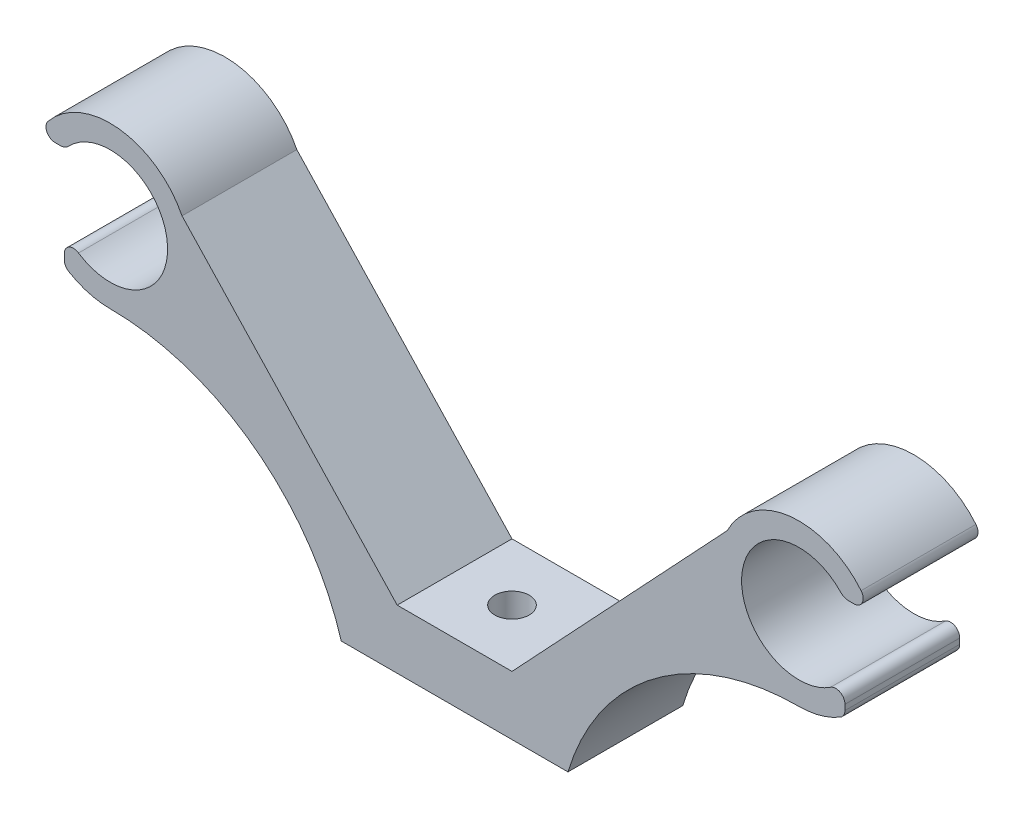
ISO-10303-21;
HEADER;
FILE_DESCRIPTION(('STEP AP214'),'2;1');
FILE_NAME('part.step','',(''),(''),'','','');
FILE_SCHEMA(('AUTOMOTIVE_DESIGN { 1 0 10303 214 1 1 1 1 }'));
ENDSEC;
DATA;
#1=APPLICATION_CONTEXT('core data for automotive mechanical design processes');
#2=APPLICATION_PROTOCOL_DEFINITION('international standard','automotive_design',2000,#1);
#3=PRODUCT_CONTEXT('',#1,'mechanical');
#4=PRODUCT('Part','Part','',(#3));
#5=PRODUCT_RELATED_PRODUCT_CATEGORY('part','',(#4));
#6=PRODUCT_DEFINITION_FORMATION('','',#4);
#7=PRODUCT_DEFINITION_CONTEXT('part definition',#1,'design');
#8=PRODUCT_DEFINITION('design','',#6,#7);
#9=PRODUCT_DEFINITION_SHAPE('','',#8);
#10=(LENGTH_UNIT() NAMED_UNIT(*) SI_UNIT(.MILLI.,.METRE.));
#11=(NAMED_UNIT(*) PLANE_ANGLE_UNIT() SI_UNIT($,.RADIAN.));
#12=(NAMED_UNIT(*) SI_UNIT($,.STERADIAN.) SOLID_ANGLE_UNIT());
#13=UNCERTAINTY_MEASURE_WITH_UNIT(LENGTH_MEASURE(1.E-05),#10,'distance_accuracy_value','');
#14=(GEOMETRIC_REPRESENTATION_CONTEXT(3) GLOBAL_UNCERTAINTY_ASSIGNED_CONTEXT((#13)) GLOBAL_UNIT_ASSIGNED_CONTEXT((#10,
#11,#12)) REPRESENTATION_CONTEXT('',''));
#15=CARTESIAN_POINT('',(0.,0.,0.));
#16=DIRECTION('',(0.,0.,1.));
#17=DIRECTION('',(1.,0.,0.));
#18=AXIS2_PLACEMENT_3D('',#15,#16,#17);
#19=CARTESIAN_POINT('',(-5.,5.14535993764462,10.));
#20=DIRECTION('',(-0.729515847590623,-0.683963908487966,0.));
#21=DIRECTION('',(0.683963908487966,-0.729515847590623,0.));
#22=AXIS2_PLACEMENT_3D('',#19,#20,#21);
#23=PLANE('',#22);
#24=DIRECTION('',(-0.683963908487966,0.729515847590623,0.));
#25=VECTOR('',#24,1.);
#26=CARTESIAN_POINT('',(-5.,5.14535993764462,0.));
#27=LINE('',#26,#25);
#28=CARTESIAN_POINT('',(-5.,5.14535993764462,0.));
#29=VERTEX_POINT('',#28);
#30=CARTESIAN_POINT('',(-23.7410390104122,25.1345505787621,0.));
#31=VERTEX_POINT('',#30);
#32=EDGE_CURVE('E225',#29,#31,#27,.T.);
#33=ORIENTED_EDGE('',*,*,#32,.T.);
#34=DIRECTION('',(0.,0.,-1.));
#35=VECTOR('',#34,1.);
#36=CARTESIAN_POINT('',(-23.7410390104122,25.1345505787621,10.));
#37=LINE('',#36,#35);
#38=CARTESIAN_POINT('',(-23.7410390104122,25.1345505787621,10.));
#39=VERTEX_POINT('',#38);
#40=EDGE_CURVE('E11',#39,#31,#37,.T.);
#41=ORIENTED_EDGE('',*,*,#40,.F.);
#42=DIRECTION('',(-0.683963908487966,0.729515847590623,0.));
#43=VECTOR('',#42,1.);
#44=CARTESIAN_POINT('',(-5.,5.14535993764462,10.));
#45=LINE('',#44,#43);
#46=CARTESIAN_POINT('',(-5.,5.14535993764462,10.));
#47=VERTEX_POINT('',#46);
#48=EDGE_CURVE('E272',#47,#39,#45,.T.);
#49=ORIENTED_EDGE('',*,*,#48,.F.);
#50=DIRECTION('',(0.,0.,-1.));
#51=VECTOR('',#50,1.);
#52=CARTESIAN_POINT('',(-5.,5.14535993764462,10.));
#53=LINE('',#52,#51);
#54=EDGE_CURVE('E221',#47,#29,#53,.T.);
#55=ORIENTED_EDGE('',*,*,#54,.T.);
#56=EDGE_LOOP('',(#33,#41,#49,#55));
#57=FACE_BOUND('',#56,.T.);
#58=ADVANCED_FACE('F33',(#57),#23,.F.);
#59=CARTESIAN_POINT('',(-30.,22.,10.));
#60=DIRECTION('',(0.,0.,-1.));
#61=DIRECTION('',(-1.,0.,0.));
#62=AXIS2_PLACEMENT_3D('',#59,#60,#61);
#63=CYLINDRICAL_SURFACE('',#62,7.);
#64=CARTESIAN_POINT('',(-30.,22.,0.));
#65=DIRECTION('',(0.,0.,1.));
#66=DIRECTION('',(1.,0.,0.));
#67=AXIS2_PLACEMENT_3D('',#64,#65,#66);
#68=CIRCLE('',#67,7.);
#69=CARTESIAN_POINT('',(-35.4098569694725,26.4422345244088,0.));
#70=VERTEX_POINT('',#69);
#71=EDGE_CURVE('E228',#31,#70,#68,.T.);
#72=ORIENTED_EDGE('',*,*,#71,.T.);
#73=DIRECTION('',(0.,0.,-1.));
#74=VECTOR('',#73,1.);
#75=CARTESIAN_POINT('',(-35.4098569694725,26.4422345244088,10.));
#76=LINE('',#75,#74);
#77=CARTESIAN_POINT('',(-35.4098569694725,26.4422345244088,10.));
#78=VERTEX_POINT('',#77);
#79=EDGE_CURVE('E41',#78,#70,#76,.T.);
#80=ORIENTED_EDGE('',*,*,#79,.F.);
#81=CARTESIAN_POINT('',(-30.,22.,10.));
#82=DIRECTION('',(0.,0.,1.));
#83=DIRECTION('',(1.,0.,0.));
#84=AXIS2_PLACEMENT_3D('',#81,#82,#83);
#85=CIRCLE('',#84,7.);
#86=EDGE_CURVE('E140',#39,#78,#85,.T.);
#87=ORIENTED_EDGE('',*,*,#86,.F.);
#88=ORIENTED_EDGE('',*,*,#40,.T.);
#89=EDGE_LOOP('',(#72,#80,#87,#88));
#90=FACE_BOUND('',#89,.T.);
#91=ADVANCED_FACE('F414',(#90),#63,.T.);
#92=CARTESIAN_POINT('',(-34.7915876015328,25.9345505787621,10.));
#93=DIRECTION('',(0.,0.,-1.));
#94=DIRECTION('',(-1.,0.,0.));
#95=AXIS2_PLACEMENT_3D('',#92,#93,#94);
#96=CYLINDRICAL_SURFACE('',#95,0.800000000000001);
#97=CARTESIAN_POINT('',(-34.7915876015328,25.9345505787621,0.));
#98=DIRECTION('',(0.,0.,1.));
#99=DIRECTION('',(-1.,0.,0.));
#100=AXIS2_PLACEMENT_3D('',#97,#98,#99);
#101=CIRCLE('',#100,0.800000000000001);
#102=CARTESIAN_POINT('',(-34.7915876015328,25.1345505787621,0.));
#103=VERTEX_POINT('',#102);
#104=EDGE_CURVE('E231',#70,#103,#101,.T.);
#105=ORIENTED_EDGE('',*,*,#104,.T.);
#106=DIRECTION('',(0.,0.,-1.));
#107=VECTOR('',#106,1.);
#108=CARTESIAN_POINT('',(-34.7915876015328,25.1345505787621,10.));
#109=LINE('',#108,#107);
#110=CARTESIAN_POINT('',(-34.7915876015328,25.1345505787621,10.));
#111=VERTEX_POINT('',#110);
#112=EDGE_CURVE('E327',#111,#103,#109,.T.);
#113=ORIENTED_EDGE('',*,*,#112,.F.);
#114=CARTESIAN_POINT('',(-34.7915876015328,25.9345505787621,10.));
#115=DIRECTION('',(0.,0.,1.));
#116=DIRECTION('',(-1.,0.,0.));
#117=AXIS2_PLACEMENT_3D('',#114,#115,#116);
#118=CIRCLE('',#117,0.800000000000001);
#119=EDGE_CURVE('E335',#78,#111,#118,.T.);
#120=ORIENTED_EDGE('',*,*,#119,.F.);
#121=ORIENTED_EDGE('',*,*,#79,.T.);
#122=EDGE_LOOP('',(#105,#113,#120,#121));
#123=FACE_BOUND('',#122,.T.);
#124=ADVANCED_FACE('F333',(#123),#96,.T.);
#125=CARTESIAN_POINT('',(-34.3480445618298,25.1345505787621,10.));
#126=DIRECTION('',(0.,1.,0.));
#127=DIRECTION('',(-1.,0.,0.));
#128=AXIS2_PLACEMENT_3D('',#125,#126,#127);
#129=PLANE('',#128);
#130=DIRECTION('',(1.,0.,0.));
#131=VECTOR('',#130,1.);
#132=CARTESIAN_POINT('',(-34.3480445618298,25.1345505787621,0.));
#133=LINE('',#132,#131);
#134=CARTESIAN_POINT('',(-34.3480445618298,25.1345505787621,0.));
#135=VERTEX_POINT('',#134);
#136=EDGE_CURVE('E233',#103,#135,#133,.T.);
#137=ORIENTED_EDGE('',*,*,#136,.T.);
#138=DIRECTION('',(0.,0.,-1.));
#139=VECTOR('',#138,1.);
#140=CARTESIAN_POINT('',(-34.3480445618298,25.1345505787621,10.));
#141=LINE('',#140,#139);
#142=CARTESIAN_POINT('',(-34.3480445618298,25.1345505787621,10.));
#143=VERTEX_POINT('',#142);
#144=EDGE_CURVE('E324',#143,#135,#141,.T.);
#145=ORIENTED_EDGE('',*,*,#144,.F.);
#146=DIRECTION('',(1.,0.,0.));
#147=VECTOR('',#146,1.);
#148=CARTESIAN_POINT('',(-34.3480445618298,25.1345505787621,10.));
#149=LINE('',#148,#147);
#150=EDGE_CURVE('E353',#111,#143,#149,.T.);
#151=ORIENTED_EDGE('',*,*,#150,.F.);
#152=ORIENTED_EDGE('',*,*,#112,.T.);
#153=EDGE_LOOP('',(#137,#145,#151,#152));
#154=FACE_BOUND('',#153,.T.);
#155=ADVANCED_FACE('F344',(#154),#129,.F.);
#156=CARTESIAN_POINT('',(-34.3480445618298,26.1345505787621,10.));
#157=DIRECTION('',(0.,0.,-1.));
#158=DIRECTION('',(-1.,0.,0.));
#159=AXIS2_PLACEMENT_3D('',#156,#157,#158);
#160=CYLINDRICAL_SURFACE('',#159,1.);
#161=CARTESIAN_POINT('',(-34.3480445618298,26.1345505787621,0.));
#162=DIRECTION('',(0.,0.,1.));
#163=DIRECTION('',(1.,0.,0.));
#164=AXIS2_PLACEMENT_3D('',#161,#162,#163);
#165=CIRCLE('',#164,1.);
#166=CARTESIAN_POINT('',(-33.6233704681915,25.4454588156351,0.));
#167=VERTEX_POINT('',#166);
#168=EDGE_CURVE('E235',#135,#167,#165,.T.);
#169=ORIENTED_EDGE('',*,*,#168,.T.);
#170=DIRECTION('',(0.,0.,-1.));
#171=VECTOR('',#170,1.);
#172=CARTESIAN_POINT('',(-33.6233704681915,25.4454588156351,10.));
#173=LINE('',#172,#171);
#174=CARTESIAN_POINT('',(-33.6233704681915,25.4454588156351,10.));
#175=VERTEX_POINT('',#174);
#176=EDGE_CURVE('E321',#175,#167,#173,.T.);
#177=ORIENTED_EDGE('',*,*,#176,.F.);
#178=CARTESIAN_POINT('',(-34.3480445618298,26.1345505787621,10.));
#179=DIRECTION('',(0.,0.,1.));
#180=DIRECTION('',(1.,0.,0.));
#181=AXIS2_PLACEMENT_3D('',#178,#179,#180);
#182=CIRCLE('',#181,1.);
#183=EDGE_CURVE('E350',#143,#175,#182,.T.);
#184=ORIENTED_EDGE('',*,*,#183,.F.);
#185=ORIENTED_EDGE('',*,*,#144,.T.);
#186=EDGE_LOOP('',(#169,#177,#184,#185));
#187=FACE_BOUND('',#186,.T.);
#188=ADVANCED_FACE('F348',(#187),#160,.T.);
#189=CARTESIAN_POINT('',(-30.,22.,10.));
#190=DIRECTION('',(0.,0.,-1.));
#191=DIRECTION('',(-1.,0.,0.));
#192=AXIS2_PLACEMENT_3D('',#189,#190,#191);
#193=CYLINDRICAL_SURFACE('',#192,5.);
#194=CARTESIAN_POINT('',(-30.,22.,0.));
#195=DIRECTION('',(0.,0.,-1.));
#196=DIRECTION('',(1.,0.,0.));
#197=AXIS2_PLACEMENT_3D('',#194,#195,#196);
#198=CIRCLE('',#197,5.);
#199=CARTESIAN_POINT('',(-32.7586206896552,17.8298666819145,0.));
#200=VERTEX_POINT('',#199);
#201=EDGE_CURVE('E237',#167,#200,#198,.T.);
#202=ORIENTED_EDGE('',*,*,#201,.T.);
#203=DIRECTION('',(0.,0.,-1.));
#204=VECTOR('',#203,1.);
#205=CARTESIAN_POINT('',(-32.7586206896552,17.8298666819145,10.));
#206=LINE('',#205,#204);
#207=CARTESIAN_POINT('',(-32.7586206896552,17.8298666819145,10.));
#208=VERTEX_POINT('',#207);
#209=EDGE_CURVE('E318',#208,#200,#206,.T.);
#210=ORIENTED_EDGE('',*,*,#209,.F.);
#211=CARTESIAN_POINT('',(-30.,22.,10.));
#212=DIRECTION('',(0.,0.,-1.));
#213=DIRECTION('',(1.,0.,0.));
#214=AXIS2_PLACEMENT_3D('',#211,#212,#213);
#215=CIRCLE('',#214,5.);
#216=EDGE_CURVE('E352',#175,#208,#215,.T.);
#217=ORIENTED_EDGE('',*,*,#216,.F.);
#218=ORIENTED_EDGE('',*,*,#176,.T.);
#219=EDGE_LOOP('',(#202,#210,#217,#218));
#220=FACE_BOUND('',#219,.T.);
#221=ADVANCED_FACE('F427',(#220),#193,.F.);
#222=CARTESIAN_POINT('',(-33.2,17.1626453510209,10.));
#223=DIRECTION('',(0.,0.,-1.));
#224=DIRECTION('',(-1.,0.,0.));
#225=AXIS2_PLACEMENT_3D('',#222,#223,#224);
#226=CYLINDRICAL_SURFACE('',#225,0.8);
#227=CARTESIAN_POINT('',(-33.2,17.1626453510209,0.));
#228=DIRECTION('',(0.,0.,1.));
#229=DIRECTION('',(-1.,0.,0.));
#230=AXIS2_PLACEMENT_3D('',#227,#228,#229);
#231=CIRCLE('',#230,0.8);
#232=CARTESIAN_POINT('',(-34.,17.1626453510209,0.));
#233=VERTEX_POINT('',#232);
#234=EDGE_CURVE('E239',#200,#233,#231,.T.);
#235=ORIENTED_EDGE('',*,*,#234,.T.);
#236=DIRECTION('',(0.,0.,-1.));
#237=VECTOR('',#236,1.);
#238=CARTESIAN_POINT('',(-34.,17.1626453510209,10.));
#239=LINE('',#238,#237);
#240=CARTESIAN_POINT('',(-34.,17.1626453510209,10.));
#241=VERTEX_POINT('',#240);
#242=EDGE_CURVE('E315',#241,#233,#239,.T.);
#243=ORIENTED_EDGE('',*,*,#242,.F.);
#244=CARTESIAN_POINT('',(-33.2,17.1626453510209,10.));
#245=DIRECTION('',(0.,0.,1.));
#246=DIRECTION('',(-1.,0.,0.));
#247=AXIS2_PLACEMENT_3D('',#244,#245,#246);
#248=CIRCLE('',#247,0.8);
#249=EDGE_CURVE('E355',#208,#241,#248,.T.);
#250=ORIENTED_EDGE('',*,*,#249,.F.);
#251=ORIENTED_EDGE('',*,*,#209,.T.);
#252=EDGE_LOOP('',(#235,#243,#250,#251));
#253=FACE_BOUND('',#252,.T.);
#254=ADVANCED_FACE('F430',(#253),#226,.T.);
#255=CARTESIAN_POINT('',(-34.,16.6896327810593,10.));
#256=DIRECTION('',(1.,0.,0.));
#257=DIRECTION('',(0.,0.,-1.));
#258=AXIS2_PLACEMENT_3D('',#255,#256,#257);
#259=PLANE('',#258);
#260=DIRECTION('',(0.,-1.,0.));
#261=VECTOR('',#260,1.);
#262=CARTESIAN_POINT('',(-34.,16.6896327810593,0.));
#263=LINE('',#262,#261);
#264=CARTESIAN_POINT('',(-34.,16.6896327810593,0.));
#265=VERTEX_POINT('',#264);
#266=EDGE_CURVE('E241',#233,#265,#263,.T.);
#267=ORIENTED_EDGE('',*,*,#266,.T.);
#268=DIRECTION('',(0.,0.,-1.));
#269=VECTOR('',#268,1.);
#270=CARTESIAN_POINT('',(-34.,16.6896327810593,10.));
#271=LINE('',#270,#269);
#272=CARTESIAN_POINT('',(-34.,16.6896327810593,10.));
#273=VERTEX_POINT('',#272);
#274=EDGE_CURVE('E312',#273,#265,#271,.T.);
#275=ORIENTED_EDGE('',*,*,#274,.F.);
#276=DIRECTION('',(0.,-1.,0.));
#277=VECTOR('',#276,1.);
#278=CARTESIAN_POINT('',(-34.,16.6896327810593,10.));
#279=LINE('',#278,#277);
#280=EDGE_CURVE('E361',#241,#273,#279,.T.);
#281=ORIENTED_EDGE('',*,*,#280,.F.);
#282=ORIENTED_EDGE('',*,*,#242,.T.);
#283=EDGE_LOOP('',(#267,#275,#281,#282));
#284=FACE_BOUND('',#283,.T.);
#285=ADVANCED_FACE('F434',(#284),#259,.F.);
#286=CARTESIAN_POINT('',(-33.2,16.6896327810593,10.));
#287=DIRECTION('',(0.,0.,-1.));
#288=DIRECTION('',(-1.,0.,0.));
#289=AXIS2_PLACEMENT_3D('',#286,#287,#288);
#290=CYLINDRICAL_SURFACE('',#289,0.800000000000003);
#291=CARTESIAN_POINT('',(-33.2,16.6896327810593,0.));
#292=DIRECTION('',(0.,0.,1.));
#293=DIRECTION('',(1.,0.,0.));
#294=AXIS2_PLACEMENT_3D('',#291,#292,#293);
#295=CIRCLE('',#294,0.800000000000003);
#296=CARTESIAN_POINT('',(-33.6129032258065,16.0044241076476,0.));
#297=VERTEX_POINT('',#296);
#298=EDGE_CURVE('E243',#265,#297,#295,.T.);
#299=ORIENTED_EDGE('',*,*,#298,.T.);
#300=DIRECTION('',(0.,0.,-1.));
#301=VECTOR('',#300,1.);
#302=CARTESIAN_POINT('',(-33.6129032258065,16.0044241076476,10.));
#303=LINE('',#302,#301);
#304=CARTESIAN_POINT('',(-33.6129032258065,16.0044241076476,10.));
#305=VERTEX_POINT('',#304);
#306=EDGE_CURVE('E309',#305,#297,#303,.T.);
#307=ORIENTED_EDGE('',*,*,#306,.F.);
#308=CARTESIAN_POINT('',(-33.2,16.6896327810593,10.));
#309=DIRECTION('',(0.,0.,1.));
#310=DIRECTION('',(1.,0.,0.));
#311=AXIS2_PLACEMENT_3D('',#308,#309,#310);
#312=CIRCLE('',#311,0.800000000000003);
#313=EDGE_CURVE('E363',#273,#305,#312,.T.);
#314=ORIENTED_EDGE('',*,*,#313,.F.);
#315=ORIENTED_EDGE('',*,*,#274,.T.);
#316=EDGE_LOOP('',(#299,#307,#314,#315));
#317=FACE_BOUND('',#316,.T.);
#318=ADVANCED_FACE('F438',(#317),#290,.T.);
#319=CARTESIAN_POINT('',(-30.,22.,10.));
#320=DIRECTION('',(0.,0.,-1.));
#321=DIRECTION('',(-1.,0.,0.));
#322=AXIS2_PLACEMENT_3D('',#319,#320,#321);
#323=CYLINDRICAL_SURFACE('',#322,7.);
#324=CARTESIAN_POINT('',(-30.,22.,0.));
#325=DIRECTION('',(0.,0.,1.));
#326=DIRECTION('',(1.,0.,0.));
#327=AXIS2_PLACEMENT_3D('',#324,#325,#326);
#328=CIRCLE('',#327,7.);
#329=CARTESIAN_POINT('',(-30.,15.,0.));
#330=VERTEX_POINT('',#329);
#331=EDGE_CURVE('E245',#297,#330,#328,.T.);
#332=ORIENTED_EDGE('',*,*,#331,.T.);
#333=DIRECTION('',(0.,0.,-1.));
#334=VECTOR('',#333,1.);
#335=CARTESIAN_POINT('',(-30.,15.,10.));
#336=LINE('',#335,#334);
#337=CARTESIAN_POINT('',(-30.,15.,10.));
#338=VERTEX_POINT('',#337);
#339=EDGE_CURVE('E306',#338,#330,#336,.T.);
#340=ORIENTED_EDGE('',*,*,#339,.F.);
#341=CARTESIAN_POINT('',(-30.,22.,10.));
#342=DIRECTION('',(0.,0.,1.));
#343=DIRECTION('',(1.,0.,0.));
#344=AXIS2_PLACEMENT_3D('',#341,#342,#343);
#345=CIRCLE('',#344,7.);
#346=EDGE_CURVE('E365',#305,#338,#345,.T.);
#347=ORIENTED_EDGE('',*,*,#346,.F.);
#348=ORIENTED_EDGE('',*,*,#306,.T.);
#349=EDGE_LOOP('',(#332,#340,#347,#348));
#350=FACE_BOUND('',#349,.T.);
#351=ADVANCED_FACE('F442',(#350),#323,.T.);
#352=CARTESIAN_POINT('',(-30.,-6.,10.));
#353=DIRECTION('',(0.,0.,-1.));
#354=DIRECTION('',(-1.,0.,0.));
#355=AXIS2_PLACEMENT_3D('',#352,#353,#354);
#356=CYLINDRICAL_SURFACE('',#355,21.);
#357=CARTESIAN_POINT('',(-30.,-6.,0.));
#358=DIRECTION('',(0.,0.,-1.));
#359=DIRECTION('',(1.,0.,0.));
#360=AXIS2_PLACEMENT_3D('',#357,#358,#359);
#361=CIRCLE('',#360,21.);
#362=CARTESIAN_POINT('',(-9.87538820250189,0.,0.));
#363=VERTEX_POINT('',#362);
#364=EDGE_CURVE('E247',#330,#363,#361,.T.);
#365=ORIENTED_EDGE('',*,*,#364,.T.);
#366=DIRECTION('',(0.,0.,-1.));
#367=VECTOR('',#366,1.);
#368=CARTESIAN_POINT('',(-9.87538820250189,0.,10.));
#369=LINE('',#368,#367);
#370=CARTESIAN_POINT('',(-9.87538820250189,0.,10.));
#371=VERTEX_POINT('',#370);
#372=EDGE_CURVE('E303',#371,#363,#369,.T.);
#373=ORIENTED_EDGE('',*,*,#372,.F.);
#374=CARTESIAN_POINT('',(-30.,-6.,10.));
#375=DIRECTION('',(0.,0.,-1.));
#376=DIRECTION('',(1.,0.,0.));
#377=AXIS2_PLACEMENT_3D('',#374,#375,#376);
#378=CIRCLE('',#377,21.);
#379=EDGE_CURVE('E367',#338,#371,#378,.T.);
#380=ORIENTED_EDGE('',*,*,#379,.F.);
#381=ORIENTED_EDGE('',*,*,#339,.T.);
#382=EDGE_LOOP('',(#365,#373,#380,#381));
#383=FACE_BOUND('',#382,.T.);
#384=ADVANCED_FACE('F446',(#383),#356,.F.);
#385=CARTESIAN_POINT('',(9.87538820250189,0.,10.));
#386=DIRECTION('',(0.,1.,0.));
#387=DIRECTION('',(0.,0.,1.));
#388=AXIS2_PLACEMENT_3D('',#385,#386,#387);
#389=PLANE('',#388);
#390=CARTESIAN_POINT('',(0.,0.,5.));
#391=DIRECTION('',(0.,1.,0.));
#392=DIRECTION('',(0.,0.,1.));
#393=AXIS2_PLACEMENT_3D('',#390,#391,#392);
#394=CIRCLE('',#393,1.5);
#395=CARTESIAN_POINT('',(0.,0.,6.5));
#396=VERTEX_POINT('',#395);
#397=EDGE_CURVE('E229',#396,#396,#394,.T.);
#398=ORIENTED_EDGE('',*,*,#397,.T.);
#399=EDGE_LOOP('',(#398));
#400=FACE_BOUND('',#399,.T.);
#401=DIRECTION('',(1.,0.,0.));
#402=VECTOR('',#401,1.);
#403=CARTESIAN_POINT('',(9.87538820250189,0.,0.));
#404=LINE('',#403,#402);
#405=CARTESIAN_POINT('',(9.87538820250189,0.,0.));
#406=VERTEX_POINT('',#405);
#407=EDGE_CURVE('E249',#363,#406,#404,.T.);
#408=ORIENTED_EDGE('',*,*,#407,.T.);
#409=DIRECTION('',(0.,0.,-1.));
#410=VECTOR('',#409,1.);
#411=CARTESIAN_POINT('',(9.87538820250189,0.,10.));
#412=LINE('',#411,#410);
#413=CARTESIAN_POINT('',(9.87538820250189,0.,10.));
#414=VERTEX_POINT('',#413);
#415=EDGE_CURVE('E300',#414,#406,#412,.T.);
#416=ORIENTED_EDGE('',*,*,#415,.F.);
#417=DIRECTION('',(1.,0.,0.));
#418=VECTOR('',#417,1.);
#419=CARTESIAN_POINT('',(9.87538820250189,0.,10.));
#420=LINE('',#419,#418);
#421=EDGE_CURVE('E369',#371,#414,#420,.T.);
#422=ORIENTED_EDGE('',*,*,#421,.F.);
#423=ORIENTED_EDGE('',*,*,#372,.T.);
#424=EDGE_LOOP('',(#408,#416,#422,#423));
#425=FACE_BOUND('',#424,.T.);
#426=ADVANCED_FACE('F450',(#400,#425),#389,.F.);
#427=CARTESIAN_POINT('',(30.,-6.,10.));
#428=DIRECTION('',(0.,0.,-1.));
#429=DIRECTION('',(-1.,0.,0.));
#430=AXIS2_PLACEMENT_3D('',#427,#428,#429);
#431=CYLINDRICAL_SURFACE('',#430,21.);
#432=CARTESIAN_POINT('',(30.,-6.,0.));
#433=DIRECTION('',(0.,0.,-1.));
#434=DIRECTION('',(-1.,0.,0.));
#435=AXIS2_PLACEMENT_3D('',#432,#433,#434);
#436=CIRCLE('',#435,21.);
#437=CARTESIAN_POINT('',(30.,15.,0.));
#438=VERTEX_POINT('',#437);
#439=EDGE_CURVE('E251',#406,#438,#436,.T.);
#440=ORIENTED_EDGE('',*,*,#439,.T.);
#441=DIRECTION('',(0.,0.,-1.));
#442=VECTOR('',#441,1.);
#443=CARTESIAN_POINT('',(30.,15.,10.));
#444=LINE('',#443,#442);
#445=CARTESIAN_POINT('',(30.,15.,10.));
#446=VERTEX_POINT('',#445);
#447=EDGE_CURVE('E297',#446,#438,#444,.T.);
#448=ORIENTED_EDGE('',*,*,#447,.F.);
#449=CARTESIAN_POINT('',(30.,-6.,10.));
#450=DIRECTION('',(0.,0.,-1.));
#451=DIRECTION('',(-1.,0.,0.));
#452=AXIS2_PLACEMENT_3D('',#449,#450,#451);
#453=CIRCLE('',#452,21.);
#454=EDGE_CURVE('E371',#414,#446,#453,.T.);
#455=ORIENTED_EDGE('',*,*,#454,.F.);
#456=ORIENTED_EDGE('',*,*,#415,.T.);
#457=EDGE_LOOP('',(#440,#448,#455,#456));
#458=FACE_BOUND('',#457,.T.);
#459=ADVANCED_FACE('F453',(#458),#431,.F.);
#460=CARTESIAN_POINT('',(30.,22.,10.));
#461=DIRECTION('',(0.,0.,-1.));
#462=DIRECTION('',(-1.,0.,0.));
#463=AXIS2_PLACEMENT_3D('',#460,#461,#462);
#464=CYLINDRICAL_SURFACE('',#463,7.);
#465=CARTESIAN_POINT('',(30.,22.,0.));
#466=DIRECTION('',(0.,0.,1.));
#467=DIRECTION('',(-1.,0.,0.));
#468=AXIS2_PLACEMENT_3D('',#465,#466,#467);
#469=CIRCLE('',#468,7.);
#470=CARTESIAN_POINT('',(33.6129032258065,16.0044241076476,0.));
#471=VERTEX_POINT('',#470);
#472=EDGE_CURVE('E253',#438,#471,#469,.T.);
#473=ORIENTED_EDGE('',*,*,#472,.T.);
#474=DIRECTION('',(0.,0.,-1.));
#475=VECTOR('',#474,1.);
#476=CARTESIAN_POINT('',(33.6129032258065,16.0044241076476,10.));
#477=LINE('',#476,#475);
#478=CARTESIAN_POINT('',(33.6129032258065,16.0044241076476,10.));
#479=VERTEX_POINT('',#478);
#480=EDGE_CURVE('E294',#479,#471,#477,.T.);
#481=ORIENTED_EDGE('',*,*,#480,.F.);
#482=CARTESIAN_POINT('',(30.,22.,10.));
#483=DIRECTION('',(0.,0.,1.));
#484=DIRECTION('',(-1.,0.,0.));
#485=AXIS2_PLACEMENT_3D('',#482,#483,#484);
#486=CIRCLE('',#485,7.);
#487=EDGE_CURVE('E373',#446,#479,#486,.T.);
#488=ORIENTED_EDGE('',*,*,#487,.F.);
#489=ORIENTED_EDGE('',*,*,#447,.T.);
#490=EDGE_LOOP('',(#473,#481,#488,#489));
#491=FACE_BOUND('',#490,.T.);
#492=ADVANCED_FACE('F457',(#491),#464,.T.);
#493=CARTESIAN_POINT('',(33.2,16.6896327810593,10.));
#494=DIRECTION('',(0.,0.,-1.));
#495=DIRECTION('',(-1.,0.,0.));
#496=AXIS2_PLACEMENT_3D('',#493,#494,#495);
#497=CYLINDRICAL_SURFACE('',#496,0.800000000000003);
#498=CARTESIAN_POINT('',(33.2,16.6896327810593,0.));
#499=DIRECTION('',(0.,0.,1.));
#500=DIRECTION('',(-1.,0.,0.));
#501=AXIS2_PLACEMENT_3D('',#498,#499,#500);
#502=CIRCLE('',#501,0.800000000000003);
#503=CARTESIAN_POINT('',(34.,16.6896327810593,0.));
#504=VERTEX_POINT('',#503);
#505=EDGE_CURVE('E255',#471,#504,#502,.T.);
#506=ORIENTED_EDGE('',*,*,#505,.T.);
#507=DIRECTION('',(0.,0.,-1.));
#508=VECTOR('',#507,1.);
#509=CARTESIAN_POINT('',(34.,16.6896327810593,10.));
#510=LINE('',#509,#508);
#511=CARTESIAN_POINT('',(34.,16.6896327810593,10.));
#512=VERTEX_POINT('',#511);
#513=EDGE_CURVE('E291',#512,#504,#510,.T.);
#514=ORIENTED_EDGE('',*,*,#513,.F.);
#515=CARTESIAN_POINT('',(33.2,16.6896327810593,10.));
#516=DIRECTION('',(0.,0.,1.));
#517=DIRECTION('',(-1.,0.,0.));
#518=AXIS2_PLACEMENT_3D('',#515,#516,#517);
#519=CIRCLE('',#518,0.800000000000003);
#520=EDGE_CURVE('E375',#479,#512,#519,.T.);
#521=ORIENTED_EDGE('',*,*,#520,.F.);
#522=ORIENTED_EDGE('',*,*,#480,.T.);
#523=EDGE_LOOP('',(#506,#514,#521,#522));
#524=FACE_BOUND('',#523,.T.);
#525=ADVANCED_FACE('F461',(#524),#497,.T.);
#526=CARTESIAN_POINT('',(34.,16.6896327810593,10.));
#527=DIRECTION('',(-1.,0.,0.));
#528=DIRECTION('',(0.,0.,1.));
#529=AXIS2_PLACEMENT_3D('',#526,#527,#528);
#530=PLANE('',#529);
#531=DIRECTION('',(0.,1.,0.));
#532=VECTOR('',#531,1.);
#533=CARTESIAN_POINT('',(34.,16.6896327810593,0.));
#534=LINE('',#533,#532);
#535=CARTESIAN_POINT('',(34.,17.1626453510209,0.));
#536=VERTEX_POINT('',#535);
#537=EDGE_CURVE('E257',#504,#536,#534,.T.);
#538=ORIENTED_EDGE('',*,*,#537,.T.);
#539=DIRECTION('',(0.,0.,-1.));
#540=VECTOR('',#539,1.);
#541=CARTESIAN_POINT('',(34.,17.1626453510209,10.));
#542=LINE('',#541,#540);
#543=CARTESIAN_POINT('',(34.,17.1626453510209,10.));
#544=VERTEX_POINT('',#543);
#545=EDGE_CURVE('E288',#544,#536,#542,.T.);
#546=ORIENTED_EDGE('',*,*,#545,.F.);
#547=DIRECTION('',(0.,1.,0.));
#548=VECTOR('',#547,1.);
#549=CARTESIAN_POINT('',(34.,16.6896327810593,10.));
#550=LINE('',#549,#548);
#551=EDGE_CURVE('E377',#512,#544,#550,.T.);
#552=ORIENTED_EDGE('',*,*,#551,.F.);
#553=ORIENTED_EDGE('',*,*,#513,.T.);
#554=EDGE_LOOP('',(#538,#546,#552,#553));
#555=FACE_BOUND('',#554,.T.);
#556=ADVANCED_FACE('F465',(#555),#530,.F.);
#557=CARTESIAN_POINT('',(33.2,17.1626453510209,10.));
#558=DIRECTION('',(0.,0.,-1.));
#559=DIRECTION('',(-1.,0.,0.));
#560=AXIS2_PLACEMENT_3D('',#557,#558,#559);
#561=CYLINDRICAL_SURFACE('',#560,0.8);
#562=CARTESIAN_POINT('',(33.2,17.1626453510209,0.));
#563=DIRECTION('',(0.,0.,1.));
#564=DIRECTION('',(1.,0.,0.));
#565=AXIS2_PLACEMENT_3D('',#562,#563,#564);
#566=CIRCLE('',#565,0.8);
#567=CARTESIAN_POINT('',(32.7586206896552,17.8298666819145,0.));
#568=VERTEX_POINT('',#567);
#569=EDGE_CURVE('E259',#536,#568,#566,.T.);
#570=ORIENTED_EDGE('',*,*,#569,.T.);
#571=DIRECTION('',(0.,0.,-1.));
#572=VECTOR('',#571,1.);
#573=CARTESIAN_POINT('',(32.7586206896552,17.8298666819145,10.));
#574=LINE('',#573,#572);
#575=CARTESIAN_POINT('',(32.7586206896552,17.8298666819145,10.));
#576=VERTEX_POINT('',#575);
#577=EDGE_CURVE('E285',#576,#568,#574,.T.);
#578=ORIENTED_EDGE('',*,*,#577,.F.);
#579=CARTESIAN_POINT('',(33.2,17.1626453510209,10.));
#580=DIRECTION('',(0.,0.,1.));
#581=DIRECTION('',(1.,0.,0.));
#582=AXIS2_PLACEMENT_3D('',#579,#580,#581);
#583=CIRCLE('',#582,0.8);
#584=EDGE_CURVE('E379',#544,#576,#583,.T.);
#585=ORIENTED_EDGE('',*,*,#584,.F.);
#586=ORIENTED_EDGE('',*,*,#545,.T.);
#587=EDGE_LOOP('',(#570,#578,#585,#586));
#588=FACE_BOUND('',#587,.T.);
#589=ADVANCED_FACE('F469',(#588),#561,.T.);
#590=CARTESIAN_POINT('',(30.,22.,10.));
#591=DIRECTION('',(0.,0.,-1.));
#592=DIRECTION('',(-1.,0.,0.));
#593=AXIS2_PLACEMENT_3D('',#590,#591,#592);
#594=CYLINDRICAL_SURFACE('',#593,5.);
#595=CARTESIAN_POINT('',(30.,22.,0.));
#596=DIRECTION('',(0.,0.,-1.));
#597=DIRECTION('',(-1.,0.,0.));
#598=AXIS2_PLACEMENT_3D('',#595,#596,#597);
#599=CIRCLE('',#598,5.);
#600=CARTESIAN_POINT('',(33.6233704681915,25.4454588156351,0.));
#601=VERTEX_POINT('',#600);
#602=EDGE_CURVE('E261',#568,#601,#599,.T.);
#603=ORIENTED_EDGE('',*,*,#602,.T.);
#604=DIRECTION('',(0.,0.,-1.));
#605=VECTOR('',#604,1.);
#606=CARTESIAN_POINT('',(33.6233704681915,25.4454588156351,10.));
#607=LINE('',#606,#605);
#608=CARTESIAN_POINT('',(33.6233704681915,25.4454588156351,10.));
#609=VERTEX_POINT('',#608);
#610=EDGE_CURVE('E282',#609,#601,#607,.T.);
#611=ORIENTED_EDGE('',*,*,#610,.F.);
#612=CARTESIAN_POINT('',(30.,22.,10.));
#613=DIRECTION('',(0.,0.,-1.));
#614=DIRECTION('',(-1.,0.,0.));
#615=AXIS2_PLACEMENT_3D('',#612,#613,#614);
#616=CIRCLE('',#615,5.);
#617=EDGE_CURVE('E381',#576,#609,#616,.T.);
#618=ORIENTED_EDGE('',*,*,#617,.F.);
#619=ORIENTED_EDGE('',*,*,#577,.T.);
#620=EDGE_LOOP('',(#603,#611,#618,#619));
#621=FACE_BOUND('',#620,.T.);
#622=ADVANCED_FACE('F473',(#621),#594,.F.);
#623=CARTESIAN_POINT('',(34.3480445618298,26.1345505787621,10.));
#624=DIRECTION('',(0.,0.,-1.));
#625=DIRECTION('',(-1.,0.,0.));
#626=AXIS2_PLACEMENT_3D('',#623,#624,#625);
#627=CYLINDRICAL_SURFACE('',#626,1.);
#628=CARTESIAN_POINT('',(34.3480445618298,26.1345505787621,0.));
#629=DIRECTION('',(0.,0.,1.));
#630=DIRECTION('',(-1.,0.,0.));
#631=AXIS2_PLACEMENT_3D('',#628,#629,#630);
#632=CIRCLE('',#631,1.);
#633=CARTESIAN_POINT('',(34.3480445618298,25.1345505787621,0.));
#634=VERTEX_POINT('',#633);
#635=EDGE_CURVE('E263',#601,#634,#632,.T.);
#636=ORIENTED_EDGE('',*,*,#635,.T.);
#637=DIRECTION('',(0.,0.,-1.));
#638=VECTOR('',#637,1.);
#639=CARTESIAN_POINT('',(34.3480445618298,25.1345505787621,10.));
#640=LINE('',#639,#638);
#641=CARTESIAN_POINT('',(34.3480445618298,25.1345505787621,10.));
#642=VERTEX_POINT('',#641);
#643=EDGE_CURVE('E279',#642,#634,#640,.T.);
#644=ORIENTED_EDGE('',*,*,#643,.F.);
#645=CARTESIAN_POINT('',(34.3480445618298,26.1345505787621,10.));
#646=DIRECTION('',(0.,0.,1.));
#647=DIRECTION('',(-1.,0.,0.));
#648=AXIS2_PLACEMENT_3D('',#645,#646,#647);
#649=CIRCLE('',#648,1.);
#650=EDGE_CURVE('E383',#609,#642,#649,.T.);
#651=ORIENTED_EDGE('',*,*,#650,.F.);
#652=ORIENTED_EDGE('',*,*,#610,.T.);
#653=EDGE_LOOP('',(#636,#644,#651,#652));
#654=FACE_BOUND('',#653,.T.);
#655=ADVANCED_FACE('F477',(#654),#627,.T.);
#656=CARTESIAN_POINT('',(34.3480445618298,25.1345505787621,10.));
#657=DIRECTION('',(0.,1.,0.));
#658=DIRECTION('',(-1.,0.,0.));
#659=AXIS2_PLACEMENT_3D('',#656,#657,#658);
#660=PLANE('',#659);
#661=DIRECTION('',(1.,0.,0.));
#662=VECTOR('',#661,1.);
#663=CARTESIAN_POINT('',(34.3480445618298,25.1345505787621,0.));
#664=LINE('',#663,#662);
#665=CARTESIAN_POINT('',(34.7915876015328,25.1345505787621,0.));
#666=VERTEX_POINT('',#665);
#667=EDGE_CURVE('E265',#634,#666,#664,.T.);
#668=ORIENTED_EDGE('',*,*,#667,.T.);
#669=DIRECTION('',(0.,0.,-1.));
#670=VECTOR('',#669,1.);
#671=CARTESIAN_POINT('',(34.7915876015328,25.1345505787621,10.));
#672=LINE('',#671,#670);
#673=CARTESIAN_POINT('',(34.7915876015328,25.1345505787621,10.));
#674=VERTEX_POINT('',#673);
#675=EDGE_CURVE('E276',#674,#666,#672,.T.);
#676=ORIENTED_EDGE('',*,*,#675,.F.);
#677=DIRECTION('',(1.,0.,0.));
#678=VECTOR('',#677,1.);
#679=CARTESIAN_POINT('',(34.3480445618298,25.1345505787621,10.));
#680=LINE('',#679,#678);
#681=EDGE_CURVE('E385',#642,#674,#680,.T.);
#682=ORIENTED_EDGE('',*,*,#681,.F.);
#683=ORIENTED_EDGE('',*,*,#643,.T.);
#684=EDGE_LOOP('',(#668,#676,#682,#683));
#685=FACE_BOUND('',#684,.T.);
#686=ADVANCED_FACE('F391',(#685),#660,.F.);
#687=CARTESIAN_POINT('',(34.7915876015328,25.9345505787621,10.));
#688=DIRECTION('',(0.,0.,-1.));
#689=DIRECTION('',(-1.,0.,0.));
#690=AXIS2_PLACEMENT_3D('',#687,#688,#689);
#691=CYLINDRICAL_SURFACE('',#690,0.800000000000001);
#692=CARTESIAN_POINT('',(34.7915876015328,25.9345505787621,0.));
#693=DIRECTION('',(0.,0.,1.));
#694=DIRECTION('',(1.,0.,0.));
#695=AXIS2_PLACEMENT_3D('',#692,#693,#694);
#696=CIRCLE('',#695,0.800000000000001);
#697=CARTESIAN_POINT('',(35.4098569694725,26.4422345244088,0.));
#698=VERTEX_POINT('',#697);
#699=EDGE_CURVE('E267',#666,#698,#696,.T.);
#700=ORIENTED_EDGE('',*,*,#699,.T.);
#701=DIRECTION('',(0.,0.,-1.));
#702=VECTOR('',#701,1.);
#703=CARTESIAN_POINT('',(35.4098569694725,26.4422345244088,10.));
#704=LINE('',#703,#702);
#705=CARTESIAN_POINT('',(35.4098569694725,26.4422345244088,10.));
#706=VERTEX_POINT('',#705);
#707=EDGE_CURVE('E216',#706,#698,#704,.T.);
#708=ORIENTED_EDGE('',*,*,#707,.F.);
#709=CARTESIAN_POINT('',(34.7915876015328,25.9345505787621,10.));
#710=DIRECTION('',(0.,0.,1.));
#711=DIRECTION('',(1.,0.,0.));
#712=AXIS2_PLACEMENT_3D('',#709,#710,#711);
#713=CIRCLE('',#712,0.800000000000001);
#714=EDGE_CURVE('E207',#674,#706,#713,.T.);
#715=ORIENTED_EDGE('',*,*,#714,.F.);
#716=ORIENTED_EDGE('',*,*,#675,.T.);
#717=EDGE_LOOP('',(#700,#708,#715,#716));
#718=FACE_BOUND('',#717,.T.);
#719=ADVANCED_FACE('F395',(#718),#691,.T.);
#720=CARTESIAN_POINT('',(30.,22.,10.));
#721=DIRECTION('',(0.,0.,-1.));
#722=DIRECTION('',(-1.,0.,0.));
#723=AXIS2_PLACEMENT_3D('',#720,#721,#722);
#724=CYLINDRICAL_SURFACE('',#723,7.);
#725=CARTESIAN_POINT('',(30.,22.,0.));
#726=DIRECTION('',(0.,0.,1.));
#727=DIRECTION('',(-1.,0.,0.));
#728=AXIS2_PLACEMENT_3D('',#725,#726,#727);
#729=CIRCLE('',#728,7.);
#730=CARTESIAN_POINT('',(23.7410390104122,25.1345505787621,0.));
#731=VERTEX_POINT('',#730);
#732=EDGE_CURVE('E215',#698,#731,#729,.T.);
#733=ORIENTED_EDGE('',*,*,#732,.T.);
#734=DIRECTION('',(0.,0.,-1.));
#735=VECTOR('',#734,1.);
#736=CARTESIAN_POINT('',(23.7410390104122,25.1345505787621,10.));
#737=LINE('',#736,#735);
#738=CARTESIAN_POINT('',(23.7410390104122,25.1345505787621,10.));
#739=VERTEX_POINT('',#738);
#740=EDGE_CURVE('E212',#739,#731,#737,.T.);
#741=ORIENTED_EDGE('',*,*,#740,.F.);
#742=CARTESIAN_POINT('',(30.,22.,10.));
#743=DIRECTION('',(0.,0.,1.));
#744=DIRECTION('',(-1.,0.,0.));
#745=AXIS2_PLACEMENT_3D('',#742,#743,#744);
#746=CIRCLE('',#745,7.);
#747=EDGE_CURVE('E201',#706,#739,#746,.T.);
#748=ORIENTED_EDGE('',*,*,#747,.F.);
#749=ORIENTED_EDGE('',*,*,#707,.T.);
#750=EDGE_LOOP('',(#733,#741,#748,#749));
#751=FACE_BOUND('',#750,.T.);
#752=ADVANCED_FACE('F213',(#751),#724,.T.);
#753=CARTESIAN_POINT('',(5.,5.14535993764462,10.));
#754=DIRECTION('',(0.729515847590623,-0.683963908487966,0.));
#755=DIRECTION('',(0.683963908487966,0.729515847590623,0.));
#756=AXIS2_PLACEMENT_3D('',#753,#754,#755);
#757=PLANE('',#756);
#758=DIRECTION('',(-0.683963908487966,-0.729515847590623,0.));
#759=VECTOR('',#758,1.);
#760=CARTESIAN_POINT('',(5.,5.14535993764462,0.));
#761=LINE('',#760,#759);
#762=CARTESIAN_POINT('',(5.,5.14535993764462,0.));
#763=VERTEX_POINT('',#762);
#764=EDGE_CURVE('E126',#731,#763,#761,.T.);
#765=ORIENTED_EDGE('',*,*,#764,.T.);
#766=DIRECTION('',(0.,0.,-1.));
#767=VECTOR('',#766,1.);
#768=CARTESIAN_POINT('',(5.,5.14535993764462,10.));
#769=LINE('',#768,#767);
#770=CARTESIAN_POINT('',(5.,5.14535993764462,10.));
#771=VERTEX_POINT('',#770);
#772=EDGE_CURVE('E217',#771,#763,#769,.T.);
#773=ORIENTED_EDGE('',*,*,#772,.F.);
#774=DIRECTION('',(-0.683963908487966,-0.729515847590623,0.));
#775=VECTOR('',#774,1.);
#776=CARTESIAN_POINT('',(5.,5.14535993764462,10.));
#777=LINE('',#776,#775);
#778=EDGE_CURVE('E205',#739,#771,#777,.T.);
#779=ORIENTED_EDGE('',*,*,#778,.F.);
#780=ORIENTED_EDGE('',*,*,#740,.T.);
#781=EDGE_LOOP('',(#765,#773,#779,#780));
#782=FACE_BOUND('',#781,.T.);
#783=ADVANCED_FACE('F219',(#782),#757,.F.);
#784=CARTESIAN_POINT('',(5.,5.14535993764462,10.));
#785=DIRECTION('',(0.,-1.,0.));
#786=DIRECTION('',(0.,0.,-1.));
#787=AXIS2_PLACEMENT_3D('',#784,#785,#786);
#788=PLANE('',#787);
#789=CARTESIAN_POINT('',(0.,5.14535993764462,5.));
#790=DIRECTION('',(0.,1.,0.));
#791=DIRECTION('',(0.,0.,1.));
#792=AXIS2_PLACEMENT_3D('',#789,#790,#791);
#793=CIRCLE('',#792,1.5);
#794=CARTESIAN_POINT('',(0.,5.14535993764462,6.5));
#795=VERTEX_POINT('',#794);
#796=EDGE_CURVE('E525',#795,#795,#793,.T.);
#797=ORIENTED_EDGE('',*,*,#796,.F.);
#798=EDGE_LOOP('',(#797));
#799=FACE_BOUND('',#798,.T.);
#800=DIRECTION('',(-1.,0.,0.));
#801=VECTOR('',#800,1.);
#802=CARTESIAN_POINT('',(5.,5.14535993764462,0.));
#803=LINE('',#802,#801);
#804=EDGE_CURVE('E132',#763,#29,#803,.T.);
#805=ORIENTED_EDGE('',*,*,#804,.T.);
#806=ORIENTED_EDGE('',*,*,#54,.F.);
#807=DIRECTION('',(-1.,0.,0.));
#808=VECTOR('',#807,1.);
#809=CARTESIAN_POINT('',(5.,5.14535993764462,10.));
#810=LINE('',#809,#808);
#811=EDGE_CURVE('E49',#771,#47,#810,.T.);
#812=ORIENTED_EDGE('',*,*,#811,.F.);
#813=ORIENTED_EDGE('',*,*,#772,.T.);
#814=EDGE_LOOP('',(#805,#806,#812,#813));
#815=FACE_BOUND('',#814,.T.);
#816=ADVANCED_FACE('F399',(#799,#815),#788,.F.);
#817=CARTESIAN_POINT('',(-30.,22.,10.));
#818=DIRECTION('',(0.,0.,1.));
#819=DIRECTION('',(1.,0.,0.));
#820=AXIS2_PLACEMENT_3D('',#817,#818,#819);
#821=PLANE('',#820);
#822=ORIENTED_EDGE('',*,*,#48,.T.);
#823=ORIENTED_EDGE('',*,*,#86,.T.);
#824=ORIENTED_EDGE('',*,*,#119,.T.);
#825=ORIENTED_EDGE('',*,*,#150,.T.);
#826=ORIENTED_EDGE('',*,*,#183,.T.);
#827=ORIENTED_EDGE('',*,*,#216,.T.);
#828=ORIENTED_EDGE('',*,*,#249,.T.);
#829=ORIENTED_EDGE('',*,*,#280,.T.);
#830=ORIENTED_EDGE('',*,*,#313,.T.);
#831=ORIENTED_EDGE('',*,*,#346,.T.);
#832=ORIENTED_EDGE('',*,*,#379,.T.);
#833=ORIENTED_EDGE('',*,*,#421,.T.);
#834=ORIENTED_EDGE('',*,*,#454,.T.);
#835=ORIENTED_EDGE('',*,*,#487,.T.);
#836=ORIENTED_EDGE('',*,*,#520,.T.);
#837=ORIENTED_EDGE('',*,*,#551,.T.);
#838=ORIENTED_EDGE('',*,*,#584,.T.);
#839=ORIENTED_EDGE('',*,*,#617,.T.);
#840=ORIENTED_EDGE('',*,*,#650,.T.);
#841=ORIENTED_EDGE('',*,*,#681,.T.);
#842=ORIENTED_EDGE('',*,*,#714,.T.);
#843=ORIENTED_EDGE('',*,*,#747,.T.);
#844=ORIENTED_EDGE('',*,*,#778,.T.);
#845=ORIENTED_EDGE('',*,*,#811,.T.);
#846=EDGE_LOOP('',(#822,#823,#824,#825,#826,#827,#828,#829,#830,#831,#832,#833,#834,#835,#836,
#837,#838,#839,#840,#841,#842,#843,#844,#845));
#847=FACE_BOUND('',#846,.T.);
#848=ADVANCED_FACE('F203',(#847),#821,.T.);
#849=CARTESIAN_POINT('',(-30.,22.,0.));
#850=DIRECTION('',(0.,0.,1.));
#851=DIRECTION('',(1.,0.,0.));
#852=AXIS2_PLACEMENT_3D('',#849,#850,#851);
#853=PLANE('',#852);
#854=ORIENTED_EDGE('',*,*,#32,.F.);
#855=ORIENTED_EDGE('',*,*,#804,.F.);
#856=ORIENTED_EDGE('',*,*,#764,.F.);
#857=ORIENTED_EDGE('',*,*,#732,.F.);
#858=ORIENTED_EDGE('',*,*,#699,.F.);
#859=ORIENTED_EDGE('',*,*,#667,.F.);
#860=ORIENTED_EDGE('',*,*,#635,.F.);
#861=ORIENTED_EDGE('',*,*,#602,.F.);
#862=ORIENTED_EDGE('',*,*,#569,.F.);
#863=ORIENTED_EDGE('',*,*,#537,.F.);
#864=ORIENTED_EDGE('',*,*,#505,.F.);
#865=ORIENTED_EDGE('',*,*,#472,.F.);
#866=ORIENTED_EDGE('',*,*,#439,.F.);
#867=ORIENTED_EDGE('',*,*,#407,.F.);
#868=ORIENTED_EDGE('',*,*,#364,.F.);
#869=ORIENTED_EDGE('',*,*,#331,.F.);
#870=ORIENTED_EDGE('',*,*,#298,.F.);
#871=ORIENTED_EDGE('',*,*,#266,.F.);
#872=ORIENTED_EDGE('',*,*,#234,.F.);
#873=ORIENTED_EDGE('',*,*,#201,.F.);
#874=ORIENTED_EDGE('',*,*,#168,.F.);
#875=ORIENTED_EDGE('',*,*,#136,.F.);
#876=ORIENTED_EDGE('',*,*,#104,.F.);
#877=ORIENTED_EDGE('',*,*,#71,.F.);
#878=EDGE_LOOP('',(#854,#855,#856,#857,#858,#859,#860,#861,#862,#863,#864,#865,#866,#867,#868,
#869,#870,#871,#872,#873,#874,#875,#876,#877));
#879=FACE_BOUND('',#878,.T.);
#880=ADVANCED_FACE('F339',(#879),#853,.F.);
#881=CARTESIAN_POINT('',(0.,-4.85464006235538,5.));
#882=DIRECTION('',(0.,1.,0.));
#883=DIRECTION('',(0.,0.,1.));
#884=AXIS2_PLACEMENT_3D('',#881,#882,#883);
#885=CYLINDRICAL_SURFACE('',#884,1.5);
#886=ORIENTED_EDGE('',*,*,#796,.T.);
#887=EDGE_LOOP('',(#886));
#888=FACE_BOUND('',#887,.T.);
#889=ORIENTED_EDGE('',*,*,#397,.F.);
#890=EDGE_LOOP('',(#889));
#891=FACE_BOUND('',#890,.T.);
#892=ADVANCED_FACE('F509',(#888,#891),#885,.F.);
#893=CLOSED_SHELL('',(#58,#91,#124,#155,#188,#221,#254,#285,#318,#351,#384,#426,#459,#492,#525,
#556,#589,#622,#655,#686,#719,#752,#783,#816,#848,#880,#892));
#894=MANIFOLD_SOLID_BREP('B2',#893);
#895=ADVANCED_BREP_SHAPE_REPRESENTATION('',(#18,#894),#14);
#896=SHAPE_DEFINITION_REPRESENTATION(#9,#895);
ENDSEC;
END-ISO-10303-21;
